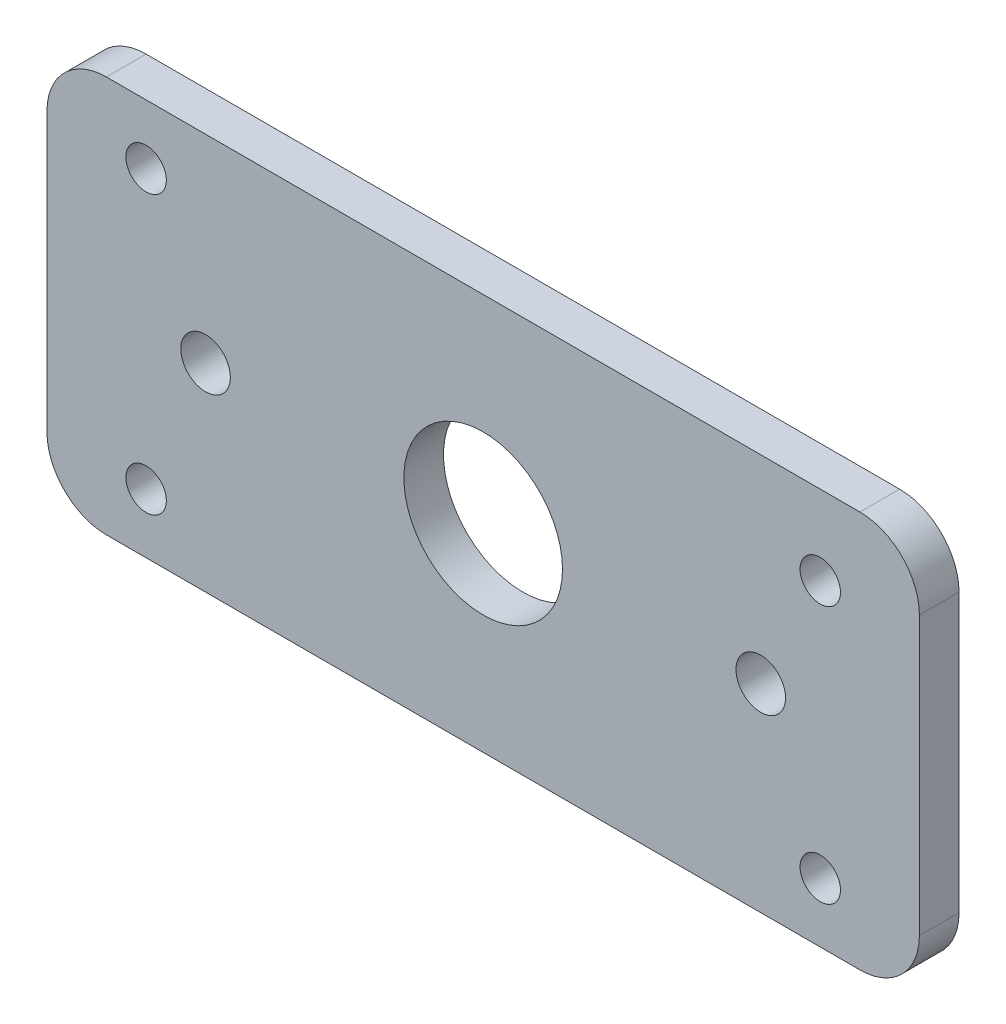
ISO-10303-21;
HEADER;
FILE_DESCRIPTION(('STEP AP214'),'2;1');
FILE_NAME('part.step','',(''),(''),'','','');
FILE_SCHEMA(('AUTOMOTIVE_DESIGN { 1 0 10303 214 1 1 1 1 }'));
ENDSEC;
DATA;
#1=APPLICATION_CONTEXT('core data for automotive mechanical design processes');
#2=APPLICATION_PROTOCOL_DEFINITION('international standard','automotive_design',2000,#1);
#3=PRODUCT_CONTEXT('',#1,'mechanical');
#4=PRODUCT('Part','Part','',(#3));
#5=PRODUCT_RELATED_PRODUCT_CATEGORY('part','',(#4));
#6=PRODUCT_DEFINITION_FORMATION('','',#4);
#7=PRODUCT_DEFINITION_CONTEXT('part definition',#1,'design');
#8=PRODUCT_DEFINITION('design','',#6,#7);
#9=PRODUCT_DEFINITION_SHAPE('','',#8);
#10=(LENGTH_UNIT() NAMED_UNIT(*) SI_UNIT(.MILLI.,.METRE.));
#11=(NAMED_UNIT(*) PLANE_ANGLE_UNIT() SI_UNIT($,.RADIAN.));
#12=(NAMED_UNIT(*) SI_UNIT($,.STERADIAN.) SOLID_ANGLE_UNIT());
#13=UNCERTAINTY_MEASURE_WITH_UNIT(LENGTH_MEASURE(1.E-05),#10,'distance_accuracy_value','');
#14=(GEOMETRIC_REPRESENTATION_CONTEXT(3) GLOBAL_UNCERTAINTY_ASSIGNED_CONTEXT((#13)) GLOBAL_UNIT_ASSIGNED_CONTEXT((#10,
#11,#12)) REPRESENTATION_CONTEXT('',''));
#15=CARTESIAN_POINT('',(0.,0.,0.));
#16=DIRECTION('',(0.,0.,1.));
#17=DIRECTION('',(1.,0.,0.));
#18=AXIS2_PLACEMENT_3D('',#15,#16,#17);
#19=CARTESIAN_POINT('',(-95.,-35.,-10.));
#20=DIRECTION('',(0.,0.,1.));
#21=DIRECTION('',(1.,0.,0.));
#22=AXIS2_PLACEMENT_3D('',#19,#20,#21);
#23=CYLINDRICAL_SURFACE('',#22,15.);
#24=CARTESIAN_POINT('',(-95.,-35.,0.));
#25=DIRECTION('',(0.,0.,1.));
#26=DIRECTION('',(-1.,0.,0.));
#27=AXIS2_PLACEMENT_3D('',#24,#25,#26);
#28=CIRCLE('',#27,15.);
#29=CARTESIAN_POINT('',(-110.,-34.9999999999999,0.));
#30=VERTEX_POINT('',#29);
#31=CARTESIAN_POINT('',(-94.9999999999999,-50.,0.));
#32=VERTEX_POINT('',#31);
#33=EDGE_CURVE('E146',#30,#32,#28,.T.);
#34=ORIENTED_EDGE('',*,*,#33,.F.);
#35=DIRECTION('',(0.,0.,1.));
#36=VECTOR('',#35,1.);
#37=CARTESIAN_POINT('',(-110.,-34.9999999999999,-10.));
#38=LINE('',#37,#36);
#39=CARTESIAN_POINT('',(-110.,-34.9999999999999,-10.));
#40=VERTEX_POINT('',#39);
#41=EDGE_CURVE('E11',#40,#30,#38,.T.);
#42=ORIENTED_EDGE('',*,*,#41,.F.);
#43=CARTESIAN_POINT('',(-95.,-35.,-10.));
#44=DIRECTION('',(0.,0.,1.));
#45=DIRECTION('',(-1.,0.,0.));
#46=AXIS2_PLACEMENT_3D('',#43,#44,#45);
#47=CIRCLE('',#46,15.);
#48=CARTESIAN_POINT('',(-94.9999999999999,-50.,-10.));
#49=VERTEX_POINT('',#48);
#50=EDGE_CURVE('E175',#40,#49,#47,.T.);
#51=ORIENTED_EDGE('',*,*,#50,.T.);
#52=DIRECTION('',(0.,0.,1.));
#53=VECTOR('',#52,1.);
#54=CARTESIAN_POINT('',(-94.9999999999999,-50.,-10.));
#55=LINE('',#54,#53);
#56=EDGE_CURVE('E45',#49,#32,#55,.T.);
#57=ORIENTED_EDGE('',*,*,#56,.T.);
#58=EDGE_LOOP('',(#34,#42,#51,#57));
#59=FACE_BOUND('',#58,.T.);
#60=ADVANCED_FACE('F42',(#59),#23,.T.);
#61=CARTESIAN_POINT('',(-110.,-34.9999999999999,-10.));
#62=DIRECTION('',(-1.,0.,0.));
#63=DIRECTION('',(0.,0.,1.));
#64=AXIS2_PLACEMENT_3D('',#61,#62,#63);
#65=PLANE('',#64);
#66=DIRECTION('',(0.,-1.,0.));
#67=VECTOR('',#66,1.);
#68=CARTESIAN_POINT('',(-110.,-34.9999999999999,0.));
#69=LINE('',#68,#67);
#70=CARTESIAN_POINT('',(-110.,34.9999999999999,0.));
#71=VERTEX_POINT('',#70);
#72=EDGE_CURVE('E172',#71,#30,#69,.T.);
#73=ORIENTED_EDGE('',*,*,#72,.F.);
#74=DIRECTION('',(0.,0.,1.));
#75=VECTOR('',#74,1.);
#76=CARTESIAN_POINT('',(-110.,34.9999999999999,-10.));
#77=LINE('',#76,#75);
#78=CARTESIAN_POINT('',(-110.,34.9999999999999,-10.));
#79=VERTEX_POINT('',#78);
#80=EDGE_CURVE('E52',#79,#71,#77,.T.);
#81=ORIENTED_EDGE('',*,*,#80,.F.);
#82=DIRECTION('',(0.,-1.,0.));
#83=VECTOR('',#82,1.);
#84=CARTESIAN_POINT('',(-110.,-34.9999999999999,-10.));
#85=LINE('',#84,#83);
#86=EDGE_CURVE('E131',#79,#40,#85,.T.);
#87=ORIENTED_EDGE('',*,*,#86,.T.);
#88=ORIENTED_EDGE('',*,*,#41,.T.);
#89=EDGE_LOOP('',(#73,#81,#87,#88));
#90=FACE_BOUND('',#89,.T.);
#91=ADVANCED_FACE('F196',(#90),#65,.T.);
#92=CARTESIAN_POINT('',(-95.,35.,-10.));
#93=DIRECTION('',(0.,0.,1.));
#94=DIRECTION('',(1.,0.,0.));
#95=AXIS2_PLACEMENT_3D('',#92,#93,#94);
#96=CYLINDRICAL_SURFACE('',#95,15.);
#97=CARTESIAN_POINT('',(-95.,35.,0.));
#98=DIRECTION('',(0.,0.,1.));
#99=DIRECTION('',(-1.,0.,0.));
#100=AXIS2_PLACEMENT_3D('',#97,#98,#99);
#101=CIRCLE('',#100,15.);
#102=CARTESIAN_POINT('',(-94.9999999999999,50.,0.));
#103=VERTEX_POINT('',#102);
#104=EDGE_CURVE('E117',#103,#71,#101,.T.);
#105=ORIENTED_EDGE('',*,*,#104,.F.);
#106=DIRECTION('',(0.,0.,1.));
#107=VECTOR('',#106,1.);
#108=CARTESIAN_POINT('',(-94.9999999999999,50.,-10.));
#109=LINE('',#108,#107);
#110=CARTESIAN_POINT('',(-94.9999999999999,50.,-10.));
#111=VERTEX_POINT('',#110);
#112=EDGE_CURVE('E112',#111,#103,#109,.T.);
#113=ORIENTED_EDGE('',*,*,#112,.F.);
#114=CARTESIAN_POINT('',(-95.,35.,-10.));
#115=DIRECTION('',(0.,0.,1.));
#116=DIRECTION('',(-1.,0.,0.));
#117=AXIS2_PLACEMENT_3D('',#114,#115,#116);
#118=CIRCLE('',#117,15.);
#119=EDGE_CURVE('E115',#111,#79,#118,.T.);
#120=ORIENTED_EDGE('',*,*,#119,.T.);
#121=ORIENTED_EDGE('',*,*,#80,.T.);
#122=EDGE_LOOP('',(#105,#113,#120,#121));
#123=FACE_BOUND('',#122,.T.);
#124=ADVANCED_FACE('F114',(#123),#96,.T.);
#125=CARTESIAN_POINT('',(-94.9999999999999,50.,-10.));
#126=DIRECTION('',(0.,1.,0.));
#127=DIRECTION('',(0.,0.,1.));
#128=AXIS2_PLACEMENT_3D('',#125,#126,#127);
#129=PLANE('',#128);
#130=DIRECTION('',(-1.,0.,0.));
#131=VECTOR('',#130,1.);
#132=CARTESIAN_POINT('',(-94.9999999999999,50.,0.));
#133=LINE('',#132,#131);
#134=CARTESIAN_POINT('',(94.9999999999999,50.,0.));
#135=VERTEX_POINT('',#134);
#136=EDGE_CURVE('E167',#135,#103,#133,.T.);
#137=ORIENTED_EDGE('',*,*,#136,.F.);
#138=DIRECTION('',(0.,0.,1.));
#139=VECTOR('',#138,1.);
#140=CARTESIAN_POINT('',(94.9999999999999,50.,-10.));
#141=LINE('',#140,#139);
#142=CARTESIAN_POINT('',(94.9999999999999,50.,-10.));
#143=VERTEX_POINT('',#142);
#144=EDGE_CURVE('E123',#143,#135,#141,.T.);
#145=ORIENTED_EDGE('',*,*,#144,.F.);
#146=DIRECTION('',(-1.,0.,0.));
#147=VECTOR('',#146,1.);
#148=CARTESIAN_POINT('',(-94.9999999999999,50.,-10.));
#149=LINE('',#148,#147);
#150=EDGE_CURVE('E129',#143,#111,#149,.T.);
#151=ORIENTED_EDGE('',*,*,#150,.T.);
#152=ORIENTED_EDGE('',*,*,#112,.T.);
#153=EDGE_LOOP('',(#137,#145,#151,#152));
#154=FACE_BOUND('',#153,.T.);
#155=ADVANCED_FACE('F134',(#154),#129,.T.);
#156=CARTESIAN_POINT('',(95.,35.,-10.));
#157=DIRECTION('',(0.,0.,1.));
#158=DIRECTION('',(1.,0.,0.));
#159=AXIS2_PLACEMENT_3D('',#156,#157,#158);
#160=CYLINDRICAL_SURFACE('',#159,15.);
#161=CARTESIAN_POINT('',(95.,35.,0.));
#162=DIRECTION('',(0.,0.,1.));
#163=DIRECTION('',(-1.,0.,0.));
#164=AXIS2_PLACEMENT_3D('',#161,#162,#163);
#165=CIRCLE('',#164,15.);
#166=CARTESIAN_POINT('',(110.,34.9999999999999,0.));
#167=VERTEX_POINT('',#166);
#168=EDGE_CURVE('E163',#167,#135,#165,.T.);
#169=ORIENTED_EDGE('',*,*,#168,.F.);
#170=DIRECTION('',(0.,0.,1.));
#171=VECTOR('',#170,1.);
#172=CARTESIAN_POINT('',(110.,34.9999999999999,-10.));
#173=LINE('',#172,#171);
#174=CARTESIAN_POINT('',(110.,34.9999999999999,-10.));
#175=VERTEX_POINT('',#174);
#176=EDGE_CURVE('E181',#175,#167,#173,.T.);
#177=ORIENTED_EDGE('',*,*,#176,.F.);
#178=CARTESIAN_POINT('',(95.,35.,-10.));
#179=DIRECTION('',(0.,0.,1.));
#180=DIRECTION('',(-1.,0.,0.));
#181=AXIS2_PLACEMENT_3D('',#178,#179,#180);
#182=CIRCLE('',#181,15.);
#183=EDGE_CURVE('E136',#175,#143,#182,.T.);
#184=ORIENTED_EDGE('',*,*,#183,.T.);
#185=ORIENTED_EDGE('',*,*,#144,.T.);
#186=EDGE_LOOP('',(#169,#177,#184,#185));
#187=FACE_BOUND('',#186,.T.);
#188=ADVANCED_FACE('F209',(#187),#160,.T.);
#189=CARTESIAN_POINT('',(110.,-34.9999999999999,-10.));
#190=DIRECTION('',(1.,0.,0.));
#191=DIRECTION('',(0.,0.,-1.));
#192=AXIS2_PLACEMENT_3D('',#189,#190,#191);
#193=PLANE('',#192);
#194=DIRECTION('',(0.,1.,0.));
#195=VECTOR('',#194,1.);
#196=CARTESIAN_POINT('',(110.,-34.9999999999999,0.));
#197=LINE('',#196,#195);
#198=CARTESIAN_POINT('',(110.,-35.,0.));
#199=VERTEX_POINT('',#198);
#200=EDGE_CURVE('E159',#199,#167,#197,.T.);
#201=ORIENTED_EDGE('',*,*,#200,.F.);
#202=DIRECTION('',(0.,0.,1.));
#203=VECTOR('',#202,1.);
#204=CARTESIAN_POINT('',(110.,-35.,-10.));
#205=LINE('',#204,#203);
#206=CARTESIAN_POINT('',(110.,-35.,-10.));
#207=VERTEX_POINT('',#206);
#208=EDGE_CURVE('E184',#207,#199,#205,.T.);
#209=ORIENTED_EDGE('',*,*,#208,.F.);
#210=DIRECTION('',(0.,1.,0.));
#211=VECTOR('',#210,1.);
#212=CARTESIAN_POINT('',(110.,-34.9999999999999,-10.));
#213=LINE('',#212,#211);
#214=EDGE_CURVE('E140',#207,#175,#213,.T.);
#215=ORIENTED_EDGE('',*,*,#214,.T.);
#216=ORIENTED_EDGE('',*,*,#176,.T.);
#217=EDGE_LOOP('',(#201,#209,#215,#216));
#218=FACE_BOUND('',#217,.T.);
#219=ADVANCED_FACE('F212',(#218),#193,.T.);
#220=CARTESIAN_POINT('',(95.,-35.,-10.));
#221=DIRECTION('',(0.,0.,1.));
#222=DIRECTION('',(1.,0.,0.));
#223=AXIS2_PLACEMENT_3D('',#220,#221,#222);
#224=CYLINDRICAL_SURFACE('',#223,15.);
#225=CARTESIAN_POINT('',(95.,-35.,0.));
#226=DIRECTION('',(0.,0.,1.));
#227=DIRECTION('',(1.,0.,0.));
#228=AXIS2_PLACEMENT_3D('',#225,#226,#227);
#229=CIRCLE('',#228,15.);
#230=CARTESIAN_POINT('',(94.9999999999999,-50.,0.));
#231=VERTEX_POINT('',#230);
#232=EDGE_CURVE('E155',#231,#199,#229,.T.);
#233=ORIENTED_EDGE('',*,*,#232,.F.);
#234=DIRECTION('',(0.,0.,1.));
#235=VECTOR('',#234,1.);
#236=CARTESIAN_POINT('',(94.9999999999999,-50.,-10.));
#237=LINE('',#236,#235);
#238=CARTESIAN_POINT('',(94.9999999999999,-50.,-10.));
#239=VERTEX_POINT('',#238);
#240=EDGE_CURVE('E186',#239,#231,#237,.T.);
#241=ORIENTED_EDGE('',*,*,#240,.F.);
#242=CARTESIAN_POINT('',(95.,-35.,-10.));
#243=DIRECTION('',(0.,0.,1.));
#244=DIRECTION('',(1.,0.,0.));
#245=AXIS2_PLACEMENT_3D('',#242,#243,#244);
#246=CIRCLE('',#245,15.);
#247=EDGE_CURVE('E324',#239,#207,#246,.T.);
#248=ORIENTED_EDGE('',*,*,#247,.T.);
#249=ORIENTED_EDGE('',*,*,#208,.T.);
#250=EDGE_LOOP('',(#233,#241,#248,#249));
#251=FACE_BOUND('',#250,.T.);
#252=ADVANCED_FACE('F216',(#251),#224,.T.);
#253=CARTESIAN_POINT('',(-94.9999999999999,-50.,-10.));
#254=DIRECTION('',(0.,-1.,0.));
#255=DIRECTION('',(0.,0.,-1.));
#256=AXIS2_PLACEMENT_3D('',#253,#254,#255);
#257=PLANE('',#256);
#258=DIRECTION('',(1.,0.,0.));
#259=VECTOR('',#258,1.);
#260=CARTESIAN_POINT('',(-94.9999999999999,-50.,0.));
#261=LINE('',#260,#259);
#262=EDGE_CURVE('E150',#32,#231,#261,.T.);
#263=ORIENTED_EDGE('',*,*,#262,.F.);
#264=ORIENTED_EDGE('',*,*,#56,.F.);
#265=DIRECTION('',(1.,0.,0.));
#266=VECTOR('',#265,1.);
#267=CARTESIAN_POINT('',(-94.9999999999999,-50.,-10.));
#268=LINE('',#267,#266);
#269=EDGE_CURVE('E321',#49,#239,#268,.T.);
#270=ORIENTED_EDGE('',*,*,#269,.T.);
#271=ORIENTED_EDGE('',*,*,#240,.T.);
#272=EDGE_LOOP('',(#263,#264,#270,#271));
#273=FACE_BOUND('',#272,.T.);
#274=ADVANCED_FACE('F193',(#273),#257,.T.);
#275=CARTESIAN_POINT('',(-95.,-35.,-10.));
#276=DIRECTION('',(0.,0.,-1.));
#277=DIRECTION('',(-1.,0.,0.));
#278=AXIS2_PLACEMENT_3D('',#275,#276,#277);
#279=PLANE('',#278);
#280=CARTESIAN_POINT('',(-85.0000000000001,35.,-10.));
#281=DIRECTION('',(0.,0.,-1.));
#282=DIRECTION('',(-1.,0.,0.));
#283=AXIS2_PLACEMENT_3D('',#280,#281,#282);
#284=CIRCLE('',#283,5.09999999999999);
#285=CARTESIAN_POINT('',(-90.1000000000001,35.,-10.));
#286=VERTEX_POINT('',#285);
#287=EDGE_CURVE('E266',#286,#286,#284,.T.);
#288=ORIENTED_EDGE('',*,*,#287,.F.);
#289=EDGE_LOOP('',(#288));
#290=FACE_BOUND('',#289,.T.);
#291=CARTESIAN_POINT('',(-85.0000000000001,-35.,-10.));
#292=DIRECTION('',(0.,0.,-1.));
#293=DIRECTION('',(-1.,0.,0.));
#294=AXIS2_PLACEMENT_3D('',#291,#292,#293);
#295=CIRCLE('',#294,5.09999999999999);
#296=CARTESIAN_POINT('',(-90.1000000000001,-35.,-10.));
#297=VERTEX_POINT('',#296);
#298=EDGE_CURVE('E270',#297,#297,#295,.T.);
#299=ORIENTED_EDGE('',*,*,#298,.F.);
#300=EDGE_LOOP('',(#299));
#301=FACE_BOUND('',#300,.T.);
#302=CARTESIAN_POINT('',(84.9999999999999,-35.,-10.));
#303=DIRECTION('',(0.,0.,-1.));
#304=DIRECTION('',(-1.,0.,0.));
#305=AXIS2_PLACEMENT_3D('',#302,#303,#304);
#306=CIRCLE('',#305,5.09999999999999);
#307=CARTESIAN_POINT('',(79.8999999999999,-35.,-10.));
#308=VERTEX_POINT('',#307);
#309=EDGE_CURVE('E280',#308,#308,#306,.T.);
#310=ORIENTED_EDGE('',*,*,#309,.F.);
#311=EDGE_LOOP('',(#310));
#312=FACE_BOUND('',#311,.T.);
#313=CARTESIAN_POINT('',(85.,30.,-10.));
#314=DIRECTION('',(0.,0.,-1.));
#315=DIRECTION('',(-1.,0.,0.));
#316=AXIS2_PLACEMENT_3D('',#313,#314,#315);
#317=CIRCLE('',#316,5.09999999999999);
#318=CARTESIAN_POINT('',(79.9,30.,-10.));
#319=VERTEX_POINT('',#318);
#320=EDGE_CURVE('E288',#319,#319,#317,.T.);
#321=ORIENTED_EDGE('',*,*,#320,.F.);
#322=EDGE_LOOP('',(#321));
#323=FACE_BOUND('',#322,.T.);
#324=CARTESIAN_POINT('',(70.,0.,-10.));
#325=DIRECTION('',(0.,0.,1.));
#326=DIRECTION('',(-1.,0.,0.));
#327=AXIS2_PLACEMENT_3D('',#324,#325,#326);
#328=CIRCLE('',#327,6.25);
#329=CARTESIAN_POINT('',(63.75,0.,-10.));
#330=VERTEX_POINT('',#329);
#331=EDGE_CURVE('E297',#330,#330,#328,.T.);
#332=ORIENTED_EDGE('',*,*,#331,.T.);
#333=EDGE_LOOP('',(#332));
#334=FACE_BOUND('',#333,.T.);
#335=CARTESIAN_POINT('',(-70.,0.,-10.));
#336=DIRECTION('',(0.,0.,1.));
#337=DIRECTION('',(1.,0.,0.));
#338=AXIS2_PLACEMENT_3D('',#335,#336,#337);
#339=CIRCLE('',#338,6.24999999999999);
#340=CARTESIAN_POINT('',(-63.75,0.,-10.));
#341=VERTEX_POINT('',#340);
#342=EDGE_CURVE('E305',#341,#341,#339,.T.);
#343=ORIENTED_EDGE('',*,*,#342,.T.);
#344=EDGE_LOOP('',(#343));
#345=FACE_BOUND('',#344,.T.);
#346=CARTESIAN_POINT('',(0.,0.,-10.));
#347=DIRECTION('',(0.,0.,1.));
#348=DIRECTION('',(1.,0.,0.));
#349=AXIS2_PLACEMENT_3D('',#346,#347,#348);
#350=CIRCLE('',#349,20.);
#351=CARTESIAN_POINT('',(20.,0.,-10.));
#352=VERTEX_POINT('',#351);
#353=EDGE_CURVE('E151',#352,#352,#350,.T.);
#354=ORIENTED_EDGE('',*,*,#353,.T.);
#355=EDGE_LOOP('',(#354));
#356=FACE_BOUND('',#355,.T.);
#357=ORIENTED_EDGE('',*,*,#50,.F.);
#358=ORIENTED_EDGE('',*,*,#86,.F.);
#359=ORIENTED_EDGE('',*,*,#119,.F.);
#360=ORIENTED_EDGE('',*,*,#150,.F.);
#361=ORIENTED_EDGE('',*,*,#183,.F.);
#362=ORIENTED_EDGE('',*,*,#214,.F.);
#363=ORIENTED_EDGE('',*,*,#247,.F.);
#364=ORIENTED_EDGE('',*,*,#269,.F.);
#365=EDGE_LOOP('',(#357,#358,#359,#360,#361,#362,#363,#364));
#366=FACE_BOUND('',#365,.T.);
#367=ADVANCED_FACE('F127',(#290,#301,#312,#323,#334,#345,#356,#366),#279,.T.);
#368=CARTESIAN_POINT('',(-95.,-35.,0.));
#369=DIRECTION('',(0.,0.,-1.));
#370=DIRECTION('',(-1.,0.,0.));
#371=AXIS2_PLACEMENT_3D('',#368,#369,#370);
#372=PLANE('',#371);
#373=CARTESIAN_POINT('',(-85.0000000000001,35.,0.));
#374=DIRECTION('',(0.,0.,-1.));
#375=DIRECTION('',(-1.,0.,0.));
#376=AXIS2_PLACEMENT_3D('',#373,#374,#375);
#377=CIRCLE('',#376,5.09999999999999);
#378=CARTESIAN_POINT('',(-90.1000000000001,35.,0.));
#379=VERTEX_POINT('',#378);
#380=EDGE_CURVE('E264',#379,#379,#377,.T.);
#381=ORIENTED_EDGE('',*,*,#380,.T.);
#382=EDGE_LOOP('',(#381));
#383=FACE_BOUND('',#382,.T.);
#384=CARTESIAN_POINT('',(-85.0000000000001,-35.,0.));
#385=DIRECTION('',(0.,0.,-1.));
#386=DIRECTION('',(-1.,0.,0.));
#387=AXIS2_PLACEMENT_3D('',#384,#385,#386);
#388=CIRCLE('',#387,5.09999999999999);
#389=CARTESIAN_POINT('',(-90.1000000000001,-35.,0.));
#390=VERTEX_POINT('',#389);
#391=EDGE_CURVE('E276',#390,#390,#388,.T.);
#392=ORIENTED_EDGE('',*,*,#391,.T.);
#393=EDGE_LOOP('',(#392));
#394=FACE_BOUND('',#393,.T.);
#395=CARTESIAN_POINT('',(84.9999999999999,-35.,0.));
#396=DIRECTION('',(0.,0.,-1.));
#397=DIRECTION('',(-1.,0.,0.));
#398=AXIS2_PLACEMENT_3D('',#395,#396,#397);
#399=CIRCLE('',#398,5.09999999999999);
#400=CARTESIAN_POINT('',(79.8999999999999,-35.,0.));
#401=VERTEX_POINT('',#400);
#402=EDGE_CURVE('E284',#401,#401,#399,.T.);
#403=ORIENTED_EDGE('',*,*,#402,.T.);
#404=EDGE_LOOP('',(#403));
#405=FACE_BOUND('',#404,.T.);
#406=CARTESIAN_POINT('',(85.,30.,0.));
#407=DIRECTION('',(0.,0.,-1.));
#408=DIRECTION('',(-1.,0.,0.));
#409=AXIS2_PLACEMENT_3D('',#406,#407,#408);
#410=CIRCLE('',#409,5.09999999999999);
#411=CARTESIAN_POINT('',(79.9,30.,0.));
#412=VERTEX_POINT('',#411);
#413=EDGE_CURVE('E292',#412,#412,#410,.T.);
#414=ORIENTED_EDGE('',*,*,#413,.T.);
#415=EDGE_LOOP('',(#414));
#416=FACE_BOUND('',#415,.T.);
#417=CARTESIAN_POINT('',(70.,0.,0.));
#418=DIRECTION('',(0.,0.,1.));
#419=DIRECTION('',(-1.,0.,0.));
#420=AXIS2_PLACEMENT_3D('',#417,#418,#419);
#421=CIRCLE('',#420,6.25);
#422=CARTESIAN_POINT('',(63.75,0.,0.));
#423=VERTEX_POINT('',#422);
#424=EDGE_CURVE('E296',#423,#423,#421,.T.);
#425=ORIENTED_EDGE('',*,*,#424,.F.);
#426=EDGE_LOOP('',(#425));
#427=FACE_BOUND('',#426,.T.);
#428=CARTESIAN_POINT('',(-70.,0.,0.));
#429=DIRECTION('',(0.,0.,1.));
#430=DIRECTION('',(1.,0.,0.));
#431=AXIS2_PLACEMENT_3D('',#428,#429,#430);
#432=CIRCLE('',#431,6.24999999999999);
#433=CARTESIAN_POINT('',(-63.75,0.,0.));
#434=VERTEX_POINT('',#433);
#435=EDGE_CURVE('E301',#434,#434,#432,.T.);
#436=ORIENTED_EDGE('',*,*,#435,.F.);
#437=EDGE_LOOP('',(#436));
#438=FACE_BOUND('',#437,.T.);
#439=CARTESIAN_POINT('',(0.,0.,0.));
#440=DIRECTION('',(0.,0.,1.));
#441=DIRECTION('',(1.,0.,0.));
#442=AXIS2_PLACEMENT_3D('',#439,#440,#441);
#443=CIRCLE('',#442,20.);
#444=CARTESIAN_POINT('',(20.,0.,0.));
#445=VERTEX_POINT('',#444);
#446=EDGE_CURVE('E309',#445,#445,#443,.T.);
#447=ORIENTED_EDGE('',*,*,#446,.F.);
#448=EDGE_LOOP('',(#447));
#449=FACE_BOUND('',#448,.T.);
#450=ORIENTED_EDGE('',*,*,#33,.T.);
#451=ORIENTED_EDGE('',*,*,#262,.T.);
#452=ORIENTED_EDGE('',*,*,#232,.T.);
#453=ORIENTED_EDGE('',*,*,#200,.T.);
#454=ORIENTED_EDGE('',*,*,#168,.T.);
#455=ORIENTED_EDGE('',*,*,#136,.T.);
#456=ORIENTED_EDGE('',*,*,#104,.T.);
#457=ORIENTED_EDGE('',*,*,#72,.T.);
#458=EDGE_LOOP('',(#450,#451,#452,#453,#454,#455,#456,#457));
#459=FACE_BOUND('',#458,.T.);
#460=ADVANCED_FACE('F195',(#383,#394,#405,#416,#427,#438,#449,#459),#372,.F.);
#461=CARTESIAN_POINT('',(0.,0.,-10.));
#462=DIRECTION('',(0.,0.,1.));
#463=DIRECTION('',(1.,0.,0.));
#464=AXIS2_PLACEMENT_3D('',#461,#462,#463);
#465=CYLINDRICAL_SURFACE('',#464,20.);
#466=ORIENTED_EDGE('',*,*,#353,.F.);
#467=EDGE_LOOP('',(#466));
#468=FACE_BOUND('',#467,.T.);
#469=ORIENTED_EDGE('',*,*,#446,.T.);
#470=EDGE_LOOP('',(#469));
#471=FACE_BOUND('',#470,.T.);
#472=ADVANCED_FACE('F228',(#468,#471),#465,.F.);
#473=CARTESIAN_POINT('',(-70.,0.,-10.));
#474=DIRECTION('',(0.,0.,1.));
#475=DIRECTION('',(1.,0.,0.));
#476=AXIS2_PLACEMENT_3D('',#473,#474,#475);
#477=CYLINDRICAL_SURFACE('',#476,6.24999999999999);
#478=ORIENTED_EDGE('',*,*,#342,.F.);
#479=EDGE_LOOP('',(#478));
#480=FACE_BOUND('',#479,.T.);
#481=ORIENTED_EDGE('',*,*,#435,.T.);
#482=EDGE_LOOP('',(#481));
#483=FACE_BOUND('',#482,.T.);
#484=ADVANCED_FACE('F235',(#480,#483),#477,.F.);
#485=CARTESIAN_POINT('',(70.,0.,-10.));
#486=DIRECTION('',(0.,0.,1.));
#487=DIRECTION('',(1.,0.,0.));
#488=AXIS2_PLACEMENT_3D('',#485,#486,#487);
#489=CYLINDRICAL_SURFACE('',#488,6.25);
#490=ORIENTED_EDGE('',*,*,#331,.F.);
#491=EDGE_LOOP('',(#490));
#492=FACE_BOUND('',#491,.T.);
#493=ORIENTED_EDGE('',*,*,#424,.T.);
#494=EDGE_LOOP('',(#493));
#495=FACE_BOUND('',#494,.T.);
#496=ADVANCED_FACE('F239',(#492,#495),#489,.F.);
#497=CARTESIAN_POINT('',(85.,30.,-10.));
#498=DIRECTION('',(0.,0.,-1.));
#499=DIRECTION('',(-1.,0.,0.));
#500=AXIS2_PLACEMENT_3D('',#497,#498,#499);
#501=CYLINDRICAL_SURFACE('',#500,5.09999999999999);
#502=ORIENTED_EDGE('',*,*,#413,.F.);
#503=EDGE_LOOP('',(#502));
#504=FACE_BOUND('',#503,.T.);
#505=ORIENTED_EDGE('',*,*,#320,.T.);
#506=EDGE_LOOP('',(#505));
#507=FACE_BOUND('',#506,.T.);
#508=ADVANCED_FACE('F243',(#504,#507),#501,.F.);
#509=CARTESIAN_POINT('',(84.9999999999999,-35.,-10.));
#510=DIRECTION('',(0.,0.,-1.));
#511=DIRECTION('',(-1.,0.,0.));
#512=AXIS2_PLACEMENT_3D('',#509,#510,#511);
#513=CYLINDRICAL_SURFACE('',#512,5.09999999999999);
#514=ORIENTED_EDGE('',*,*,#402,.F.);
#515=EDGE_LOOP('',(#514));
#516=FACE_BOUND('',#515,.T.);
#517=ORIENTED_EDGE('',*,*,#309,.T.);
#518=EDGE_LOOP('',(#517));
#519=FACE_BOUND('',#518,.T.);
#520=ADVANCED_FACE('F247',(#516,#519),#513,.F.);
#521=CARTESIAN_POINT('',(-85.0000000000001,-35.,-10.));
#522=DIRECTION('',(0.,0.,-1.));
#523=DIRECTION('',(-1.,0.,0.));
#524=AXIS2_PLACEMENT_3D('',#521,#522,#523);
#525=CYLINDRICAL_SURFACE('',#524,5.09999999999999);
#526=ORIENTED_EDGE('',*,*,#391,.F.);
#527=EDGE_LOOP('',(#526));
#528=FACE_BOUND('',#527,.T.);
#529=ORIENTED_EDGE('',*,*,#298,.T.);
#530=EDGE_LOOP('',(#529));
#531=FACE_BOUND('',#530,.T.);
#532=ADVANCED_FACE('F251',(#528,#531),#525,.F.);
#533=CARTESIAN_POINT('',(-85.0000000000001,35.,-10.));
#534=DIRECTION('',(0.,0.,-1.));
#535=DIRECTION('',(-1.,0.,0.));
#536=AXIS2_PLACEMENT_3D('',#533,#534,#535);
#537=CYLINDRICAL_SURFACE('',#536,5.09999999999999);
#538=ORIENTED_EDGE('',*,*,#380,.F.);
#539=EDGE_LOOP('',(#538));
#540=FACE_BOUND('',#539,.T.);
#541=ORIENTED_EDGE('',*,*,#287,.T.);
#542=EDGE_LOOP('',(#541));
#543=FACE_BOUND('',#542,.T.);
#544=ADVANCED_FACE('F255',(#540,#543),#537,.F.);
#545=CLOSED_SHELL('',(#60,#91,#124,#155,#188,#219,#252,#274,#367,#460,#472,#484,#496,#508,#520,
#532,#544));
#546=MANIFOLD_SOLID_BREP('B2',#545);
#547=ADVANCED_BREP_SHAPE_REPRESENTATION('',(#18,#546),#14);
#548=SHAPE_DEFINITION_REPRESENTATION(#9,#547);
ENDSEC;
END-ISO-10303-21;
